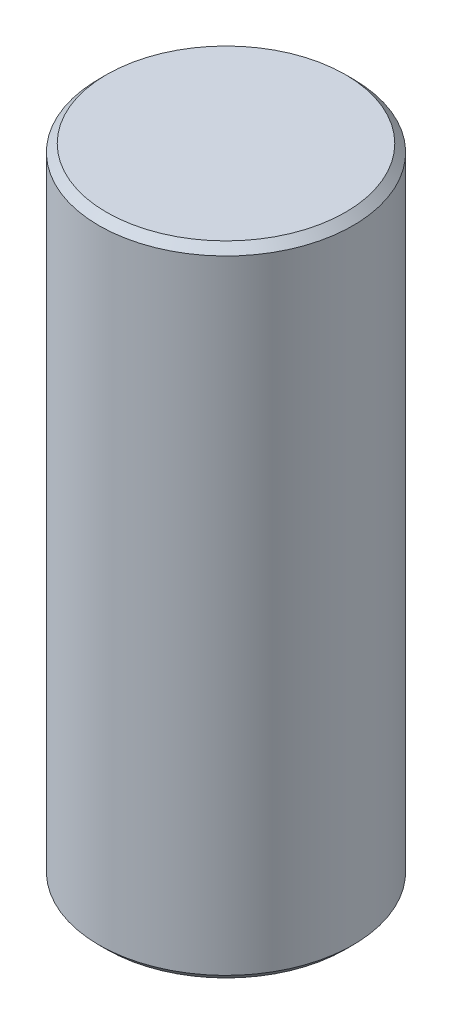
ISO-10303-21;
HEADER;
FILE_DESCRIPTION(('STEP AP214'),'2;1');
FILE_NAME('part.step','',(''),(''),'','','');
FILE_SCHEMA(('AUTOMOTIVE_DESIGN { 1 0 10303 214 1 1 1 1 }'));
ENDSEC;
DATA;
#1=APPLICATION_CONTEXT('core data for automotive mechanical design processes');
#2=APPLICATION_PROTOCOL_DEFINITION('international standard','automotive_design',2000,#1);
#3=PRODUCT_CONTEXT('',#1,'mechanical');
#4=PRODUCT('Part','Part','',(#3));
#5=PRODUCT_RELATED_PRODUCT_CATEGORY('part','',(#4));
#6=PRODUCT_DEFINITION_FORMATION('','',#4);
#7=PRODUCT_DEFINITION_CONTEXT('part definition',#1,'design');
#8=PRODUCT_DEFINITION('design','',#6,#7);
#9=PRODUCT_DEFINITION_SHAPE('','',#8);
#10=(LENGTH_UNIT() NAMED_UNIT(*) SI_UNIT(.MILLI.,.METRE.));
#11=(NAMED_UNIT(*) PLANE_ANGLE_UNIT() SI_UNIT($,.RADIAN.));
#12=(NAMED_UNIT(*) SI_UNIT($,.STERADIAN.) SOLID_ANGLE_UNIT());
#13=UNCERTAINTY_MEASURE_WITH_UNIT(LENGTH_MEASURE(1.E-05),#10,'distance_accuracy_value','');
#14=(GEOMETRIC_REPRESENTATION_CONTEXT(3) GLOBAL_UNCERTAINTY_ASSIGNED_CONTEXT((#13)) GLOBAL_UNIT_ASSIGNED_CONTEXT((#10,
#11,#12)) REPRESENTATION_CONTEXT('',''));
#15=CARTESIAN_POINT('',(0.,0.,0.));
#16=DIRECTION('',(0.,0.,1.));
#17=DIRECTION('',(1.,0.,0.));
#18=AXIS2_PLACEMENT_3D('',#15,#16,#17);
#19=CARTESIAN_POINT('',(0.,0.,0.));
#20=DIRECTION('',(0.,-1.,0.));
#21=DIRECTION('',(0.,0.,-1.));
#22=AXIS2_PLACEMENT_3D('',#19,#20,#21);
#23=CYLINDRICAL_SURFACE('',#22,6.3754);
#24=CARTESIAN_POINT('',(0.,0.,0.));
#25=DIRECTION('',(0.,-1.,0.));
#26=DIRECTION('',(0.,0.,-1.));
#27=AXIS2_PLACEMENT_3D('',#24,#25,#26);
#28=CIRCLE('',#27,6.3754);
#29=CARTESIAN_POINT('',(0.,0.,-6.37540000000001));
#30=VERTEX_POINT('',#29);
#31=EDGE_CURVE('E10',#30,#30,#28,.T.);
#32=ORIENTED_EDGE('',*,*,#31,.T.);
#33=EDGE_LOOP('',(#32));
#34=FACE_BOUND('',#33,.T.);
#35=CARTESIAN_POINT('',(0.,4.57199999999999,0.));
#36=DIRECTION('',(0.,-1.,0.));
#37=DIRECTION('',(0.,0.,-1.));
#38=AXIS2_PLACEMENT_3D('',#35,#36,#37);
#39=CIRCLE('',#38,6.3754);
#40=CARTESIAN_POINT('',(0.,4.57199999999999,-6.37540000000001));
#41=VERTEX_POINT('',#40);
#42=EDGE_CURVE('E53',#41,#41,#39,.T.);
#43=ORIENTED_EDGE('',*,*,#42,.F.);
#44=EDGE_LOOP('',(#43));
#45=FACE_BOUND('',#44,.T.);
#46=ADVANCED_FACE('F28',(#34,#45),#23,.F.);
#47=CARTESIAN_POINT('',(11.8745,0.,0.));
#48=DIRECTION('',(0.,-1.,0.));
#49=DIRECTION('',(0.,0.,-1.));
#50=AXIS2_PLACEMENT_3D('',#47,#48,#49);
#51=PLANE('',#50);
#52=CARTESIAN_POINT('',(0.,0.,0.));
#53=DIRECTION('',(0.,-1.,0.));
#54=DIRECTION('',(0.,0.,-1.));
#55=AXIS2_PLACEMENT_3D('',#52,#53,#54);
#56=CIRCLE('',#55,11.8745);
#57=CARTESIAN_POINT('',(0.,0.,-11.8745));
#58=VERTEX_POINT('',#57);
#59=EDGE_CURVE('E34',#58,#58,#56,.T.);
#60=ORIENTED_EDGE('',*,*,#59,.T.);
#61=EDGE_LOOP('',(#60));
#62=FACE_BOUND('',#61,.T.);
#63=ORIENTED_EDGE('',*,*,#31,.F.);
#64=EDGE_LOOP('',(#63));
#65=FACE_BOUND('',#64,.T.);
#66=ADVANCED_FACE('F61',(#62,#65),#51,.T.);
#67=CARTESIAN_POINT('',(0.,0.,0.));
#68=DIRECTION('',(0.,1.,0.));
#69=DIRECTION('',(0.,0.,1.));
#70=AXIS2_PLACEMENT_3D('',#67,#68,#69);
#71=CONICAL_SURFACE('',#70,11.8745,0.785398163397449);
#72=CARTESIAN_POINT('',(0.,0.761999999999999,0.));
#73=DIRECTION('',(0.,-1.,0.));
#74=DIRECTION('',(0.,0.,-1.));
#75=AXIS2_PLACEMENT_3D('',#72,#73,#74);
#76=CIRCLE('',#75,12.6365);
#77=CARTESIAN_POINT('',(0.,0.761999999999999,-12.6365));
#78=VERTEX_POINT('',#77);
#79=EDGE_CURVE('E38',#78,#78,#76,.T.);
#80=ORIENTED_EDGE('',*,*,#79,.T.);
#81=EDGE_LOOP('',(#80));
#82=FACE_BOUND('',#81,.T.);
#83=ORIENTED_EDGE('',*,*,#59,.F.);
#84=EDGE_LOOP('',(#83));
#85=FACE_BOUND('',#84,.T.);
#86=ADVANCED_FACE('F65',(#82,#85),#71,.T.);
#87=CARTESIAN_POINT('',(0.,0.,0.));
#88=DIRECTION('',(0.,-1.,0.));
#89=DIRECTION('',(0.,0.,-1.));
#90=AXIS2_PLACEMENT_3D('',#87,#88,#89);
#91=CYLINDRICAL_SURFACE('',#90,12.6365);
#92=CARTESIAN_POINT('',(0.,62.738,0.));
#93=DIRECTION('',(0.,-1.,0.));
#94=DIRECTION('',(0.,0.,-1.));
#95=AXIS2_PLACEMENT_3D('',#92,#93,#94);
#96=CIRCLE('',#95,12.6365);
#97=CARTESIAN_POINT('',(0.,62.738,-12.6365));
#98=VERTEX_POINT('',#97);
#99=EDGE_CURVE('E42',#98,#98,#96,.T.);
#100=ORIENTED_EDGE('',*,*,#99,.T.);
#101=EDGE_LOOP('',(#100));
#102=FACE_BOUND('',#101,.T.);
#103=ORIENTED_EDGE('',*,*,#79,.F.);
#104=EDGE_LOOP('',(#103));
#105=FACE_BOUND('',#104,.T.);
#106=ADVANCED_FACE('F69',(#102,#105),#91,.T.);
#107=CARTESIAN_POINT('',(0.,62.738,0.));
#108=DIRECTION('',(0.,-1.,0.));
#109=DIRECTION('',(0.,0.,-1.));
#110=AXIS2_PLACEMENT_3D('',#107,#108,#109);
#111=CONICAL_SURFACE('',#110,12.6365,0.78539816339745);
#112=CARTESIAN_POINT('',(0.,63.5,0.));
#113=DIRECTION('',(0.,-1.,0.));
#114=DIRECTION('',(0.,0.,-1.));
#115=AXIS2_PLACEMENT_3D('',#112,#113,#114);
#116=CIRCLE('',#115,11.8745);
#117=CARTESIAN_POINT('',(0.,63.5,-11.8745));
#118=VERTEX_POINT('',#117);
#119=EDGE_CURVE('E47',#118,#118,#116,.T.);
#120=ORIENTED_EDGE('',*,*,#119,.T.);
#121=EDGE_LOOP('',(#120));
#122=FACE_BOUND('',#121,.T.);
#123=ORIENTED_EDGE('',*,*,#99,.F.);
#124=EDGE_LOOP('',(#123));
#125=FACE_BOUND('',#124,.T.);
#126=ADVANCED_FACE('F76',(#122,#125),#111,.T.);
#127=CARTESIAN_POINT('',(11.8745,63.5,0.));
#128=DIRECTION('',(0.,1.,0.));
#129=DIRECTION('',(0.,0.,1.));
#130=AXIS2_PLACEMENT_3D('',#127,#128,#129);
#131=PLANE('',#130);
#132=ORIENTED_EDGE('',*,*,#119,.F.);
#133=EDGE_LOOP('',(#132));
#134=FACE_BOUND('',#133,.T.);
#135=ADVANCED_FACE('F80',(#134),#131,.T.);
#136=CARTESIAN_POINT('',(6.12140000000003,4.826,0.));
#137=DIRECTION('',(0.,-1.,0.));
#138=DIRECTION('',(0.,0.,-1.));
#139=AXIS2_PLACEMENT_3D('',#136,#137,#138);
#140=PLANE('',#139);
#141=CARTESIAN_POINT('',(0.,4.826,0.));
#142=DIRECTION('',(0.,-1.,0.));
#143=DIRECTION('',(0.,0.,-1.));
#144=AXIS2_PLACEMENT_3D('',#141,#142,#143);
#145=CIRCLE('',#144,6.1214);
#146=CARTESIAN_POINT('',(0.,4.826,-6.12140000000001));
#147=VERTEX_POINT('',#146);
#148=EDGE_CURVE('E50',#147,#147,#145,.T.);
#149=ORIENTED_EDGE('',*,*,#148,.T.);
#150=EDGE_LOOP('',(#149));
#151=FACE_BOUND('',#150,.T.);
#152=ADVANCED_FACE('F84',(#151),#140,.T.);
#153=CARTESIAN_POINT('',(0.,4.826,0.));
#154=DIRECTION('',(0.,-1.,0.));
#155=DIRECTION('',(0.,0.,-1.));
#156=AXIS2_PLACEMENT_3D('',#153,#154,#155);
#157=CONICAL_SURFACE('',#156,6.1214,0.785398163397448);
#158=ORIENTED_EDGE('',*,*,#42,.T.);
#159=EDGE_LOOP('',(#158));
#160=FACE_BOUND('',#159,.T.);
#161=ORIENTED_EDGE('',*,*,#148,.F.);
#162=EDGE_LOOP('',(#161));
#163=FACE_BOUND('',#162,.T.);
#164=ADVANCED_FACE('F57',(#160,#163),#157,.F.);
#165=CLOSED_SHELL('',(#46,#66,#86,#106,#126,#135,#152,#164));
#166=MANIFOLD_SOLID_BREP('B2',#165);
#167=ADVANCED_BREP_SHAPE_REPRESENTATION('',(#18,#166),#14);
#168=SHAPE_DEFINITION_REPRESENTATION(#9,#167);
ENDSEC;
END-ISO-10303-21;
